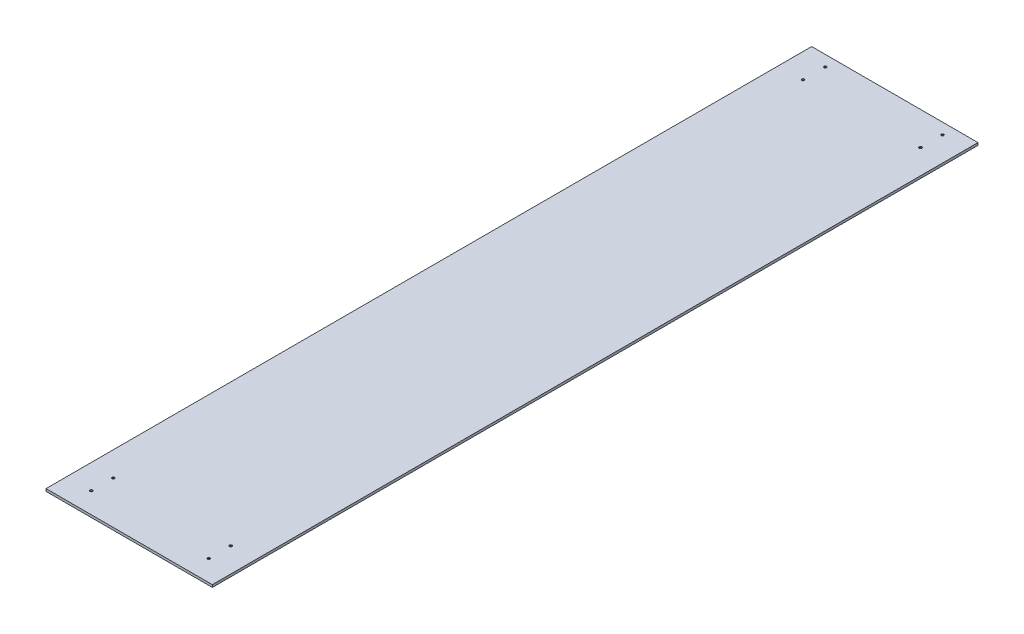
ISO-10303-21;
HEADER;
FILE_DESCRIPTION(('STEP AP214'),'2;1');
FILE_NAME('part.step','',(''),(''),'','','');
FILE_SCHEMA(('AUTOMOTIVE_DESIGN { 1 0 10303 214 1 1 1 1 }'));
ENDSEC;
DATA;
#1=APPLICATION_CONTEXT('core data for automotive mechanical design processes');
#2=APPLICATION_PROTOCOL_DEFINITION('international standard','automotive_design',2000,#1);
#3=PRODUCT_CONTEXT('',#1,'mechanical');
#4=PRODUCT('Part','Part','',(#3));
#5=PRODUCT_RELATED_PRODUCT_CATEGORY('part','',(#4));
#6=PRODUCT_DEFINITION_FORMATION('','',#4);
#7=PRODUCT_DEFINITION_CONTEXT('part definition',#1,'design');
#8=PRODUCT_DEFINITION('design','',#6,#7);
#9=PRODUCT_DEFINITION_SHAPE('','',#8);
#10=(LENGTH_UNIT() NAMED_UNIT(*) SI_UNIT(.MILLI.,.METRE.));
#11=(NAMED_UNIT(*) PLANE_ANGLE_UNIT() SI_UNIT($,.RADIAN.));
#12=(NAMED_UNIT(*) SI_UNIT($,.STERADIAN.) SOLID_ANGLE_UNIT());
#13=UNCERTAINTY_MEASURE_WITH_UNIT(LENGTH_MEASURE(1.E-05),#10,'distance_accuracy_value','');
#14=(GEOMETRIC_REPRESENTATION_CONTEXT(3) GLOBAL_UNCERTAINTY_ASSIGNED_CONTEXT((#13)) GLOBAL_UNIT_ASSIGNED_CONTEXT((#10,
#11,#12)) REPRESENTATION_CONTEXT('',''));
#15=CARTESIAN_POINT('',(0.,0.,0.));
#16=DIRECTION('',(0.,0.,1.));
#17=DIRECTION('',(1.,0.,0.));
#18=AXIS2_PLACEMENT_3D('',#15,#16,#17);
#19=CARTESIAN_POINT('',(0.,-6.35,993.775));
#20=DIRECTION('',(-1.,0.,0.));
#21=DIRECTION('',(0.,0.,1.));
#22=AXIS2_PLACEMENT_3D('',#19,#20,#21);
#23=PLANE('',#22);
#24=DIRECTION('',(0.,0.,1.));
#25=VECTOR('',#24,1.);
#26=CARTESIAN_POINT('',(0.,0.,993.775));
#27=LINE('',#26,#25);
#28=CARTESIAN_POINT('',(0.,0.,0.));
#29=VERTEX_POINT('',#28);
#30=CARTESIAN_POINT('',(-3.60822483003176E-13,0.,1987.55));
#31=VERTEX_POINT('',#30);
#32=EDGE_CURVE('E102',#29,#31,#27,.T.);
#33=ORIENTED_EDGE('',*,*,#32,.F.);
#34=DIRECTION('',(0.,1.,0.));
#35=VECTOR('',#34,1.);
#36=CARTESIAN_POINT('',(0.,-6.35,0.));
#37=LINE('',#36,#35);
#38=CARTESIAN_POINT('',(0.,-6.35,0.));
#39=VERTEX_POINT('',#38);
#40=EDGE_CURVE('E9',#39,#29,#37,.T.);
#41=ORIENTED_EDGE('',*,*,#40,.F.);
#42=DIRECTION('',(0.,0.,1.));
#43=VECTOR('',#42,1.);
#44=CARTESIAN_POINT('',(0.,-6.35,993.775));
#45=LINE('',#44,#43);
#46=CARTESIAN_POINT('',(-3.60822483003176E-13,-6.35,1987.55));
#47=VERTEX_POINT('',#46);
#48=EDGE_CURVE('E79',#39,#47,#45,.T.);
#49=ORIENTED_EDGE('',*,*,#48,.T.);
#50=DIRECTION('',(0.,1.,0.));
#51=VECTOR('',#50,1.);
#52=CARTESIAN_POINT('',(-3.60822483003176E-13,-6.35,1987.55));
#53=LINE('',#52,#51);
#54=EDGE_CURVE('E38',#47,#31,#53,.T.);
#55=ORIENTED_EDGE('',*,*,#54,.T.);
#56=EDGE_LOOP('',(#33,#41,#49,#55));
#57=FACE_BOUND('',#56,.T.);
#58=ADVANCED_FACE('F14',(#57),#23,.T.);
#59=CARTESIAN_POINT('',(215.9,-6.35,0.));
#60=DIRECTION('',(0.,0.,1.));
#61=DIRECTION('',(1.,0.,0.));
#62=AXIS2_PLACEMENT_3D('',#59,#60,#61);
#63=PLANE('',#62);
#64=DIRECTION('',(1.,0.,0.));
#65=VECTOR('',#64,1.);
#66=CARTESIAN_POINT('',(215.9,0.,0.));
#67=LINE('',#66,#65);
#68=CARTESIAN_POINT('',(431.8,0.,0.));
#69=VERTEX_POINT('',#68);
#70=EDGE_CURVE('E86',#29,#69,#67,.T.);
#71=ORIENTED_EDGE('',*,*,#70,.T.);
#72=DIRECTION('',(0.,1.,0.));
#73=VECTOR('',#72,1.);
#74=CARTESIAN_POINT('',(431.8,-6.35,0.));
#75=LINE('',#74,#73);
#76=CARTESIAN_POINT('',(431.8,-6.35,0.));
#77=VERTEX_POINT('',#76);
#78=EDGE_CURVE('E24',#77,#69,#75,.T.);
#79=ORIENTED_EDGE('',*,*,#78,.F.);
#80=DIRECTION('',(1.,0.,0.));
#81=VECTOR('',#80,1.);
#82=CARTESIAN_POINT('',(215.9,-6.35,0.));
#83=LINE('',#82,#81);
#84=EDGE_CURVE('E73',#39,#77,#83,.T.);
#85=ORIENTED_EDGE('',*,*,#84,.F.);
#86=ORIENTED_EDGE('',*,*,#40,.T.);
#87=EDGE_LOOP('',(#71,#79,#85,#86));
#88=FACE_BOUND('',#87,.T.);
#89=ADVANCED_FACE('F84',(#88),#63,.F.);
#90=CARTESIAN_POINT('',(431.8,-6.35,993.775));
#91=DIRECTION('',(-1.,0.,0.));
#92=DIRECTION('',(0.,0.,1.));
#93=AXIS2_PLACEMENT_3D('',#90,#91,#92);
#94=PLANE('',#93);
#95=DIRECTION('',(0.,0.,1.));
#96=VECTOR('',#95,1.);
#97=CARTESIAN_POINT('',(431.8,0.,993.775));
#98=LINE('',#97,#96);
#99=CARTESIAN_POINT('',(431.8,0.,1987.55));
#100=VERTEX_POINT('',#99);
#101=EDGE_CURVE('E108',#69,#100,#98,.T.);
#102=ORIENTED_EDGE('',*,*,#101,.T.);
#103=DIRECTION('',(0.,1.,0.));
#104=VECTOR('',#103,1.);
#105=CARTESIAN_POINT('',(431.8,-6.35,1987.55));
#106=LINE('',#105,#104);
#107=CARTESIAN_POINT('',(431.8,-6.35,1987.55));
#108=VERTEX_POINT('',#107);
#109=EDGE_CURVE('E56',#108,#100,#106,.T.);
#110=ORIENTED_EDGE('',*,*,#109,.F.);
#111=DIRECTION('',(0.,0.,1.));
#112=VECTOR('',#111,1.);
#113=CARTESIAN_POINT('',(431.8,-6.35,993.775));
#114=LINE('',#113,#112);
#115=EDGE_CURVE('E78',#77,#108,#114,.T.);
#116=ORIENTED_EDGE('',*,*,#115,.F.);
#117=ORIENTED_EDGE('',*,*,#78,.T.);
#118=EDGE_LOOP('',(#102,#110,#116,#117));
#119=FACE_BOUND('',#118,.T.);
#120=ADVANCED_FACE('F91',(#119),#94,.F.);
#121=CARTESIAN_POINT('',(215.9,-6.35,1987.55));
#122=DIRECTION('',(0.,0.,1.));
#123=DIRECTION('',(1.,0.,0.));
#124=AXIS2_PLACEMENT_3D('',#121,#122,#123);
#125=PLANE('',#124);
#126=DIRECTION('',(1.,0.,0.));
#127=VECTOR('',#126,1.);
#128=CARTESIAN_POINT('',(215.9,0.,1987.55));
#129=LINE('',#128,#127);
#130=EDGE_CURVE('E110',#31,#100,#129,.T.);
#131=ORIENTED_EDGE('',*,*,#130,.F.);
#132=ORIENTED_EDGE('',*,*,#54,.F.);
#133=DIRECTION('',(1.,0.,0.));
#134=VECTOR('',#133,1.);
#135=CARTESIAN_POINT('',(215.9,-6.35,1987.55));
#136=LINE('',#135,#134);
#137=EDGE_CURVE('E93',#47,#108,#136,.T.);
#138=ORIENTED_EDGE('',*,*,#137,.T.);
#139=ORIENTED_EDGE('',*,*,#109,.T.);
#140=EDGE_LOOP('',(#131,#132,#138,#139));
#141=FACE_BOUND('',#140,.T.);
#142=ADVANCED_FACE('F210',(#141),#125,.T.);
#143=CARTESIAN_POINT('',(215.9,-6.35,993.775));
#144=DIRECTION('',(0.,-1.,0.));
#145=DIRECTION('',(1.,0.,0.));
#146=AXIS2_PLACEMENT_3D('',#143,#144,#145);
#147=PLANE('',#146);
#148=CARTESIAN_POINT('',(368.3,-6.34999999999986,28.575));
#149=DIRECTION('',(0.,-1.,0.));
#150=DIRECTION('',(0.,0.,-1.));
#151=AXIS2_PLACEMENT_3D('',#148,#149,#150);
#152=CIRCLE('',#151,6.7437);
#153=CARTESIAN_POINT('',(368.3,-6.34999999999986,21.8313));
#154=VERTEX_POINT('',#153);
#155=EDGE_CURVE('E450',#154,#154,#152,.T.);
#156=ORIENTED_EDGE('',*,*,#155,.F.);
#157=EDGE_LOOP('',(#156));
#158=FACE_BOUND('',#157,.T.);
#159=CARTESIAN_POINT('',(368.3,-6.34999999999986,85.725));
#160=DIRECTION('',(0.,-1.,0.));
#161=DIRECTION('',(0.,0.,-1.));
#162=AXIS2_PLACEMENT_3D('',#159,#160,#161);
#163=CIRCLE('',#162,6.7437);
#164=CARTESIAN_POINT('',(368.3,-6.34999999999986,78.9813));
#165=VERTEX_POINT('',#164);
#166=EDGE_CURVE('E166',#165,#165,#163,.T.);
#167=ORIENTED_EDGE('',*,*,#166,.F.);
#168=EDGE_LOOP('',(#167));
#169=FACE_BOUND('',#168,.T.);
#170=CARTESIAN_POINT('',(368.3,-6.34999999999986,1933.575));
#171=DIRECTION('',(0.,-1.,0.));
#172=DIRECTION('',(0.,0.,-1.));
#173=AXIS2_PLACEMENT_3D('',#170,#171,#172);
#174=CIRCLE('',#173,6.7437);
#175=CARTESIAN_POINT('',(368.3,-6.34999999999986,1926.8313));
#176=VERTEX_POINT('',#175);
#177=EDGE_CURVE('E154',#176,#176,#174,.T.);
#178=ORIENTED_EDGE('',*,*,#177,.F.);
#179=EDGE_LOOP('',(#178));
#180=FACE_BOUND('',#179,.T.);
#181=CARTESIAN_POINT('',(368.3,-6.34999999999986,1876.425));
#182=DIRECTION('',(0.,-1.,0.));
#183=DIRECTION('',(0.,0.,-1.));
#184=AXIS2_PLACEMENT_3D('',#181,#182,#183);
#185=CIRCLE('',#184,6.7437);
#186=CARTESIAN_POINT('',(368.3,-6.34999999999986,1869.6813));
#187=VERTEX_POINT('',#186);
#188=EDGE_CURVE('E149',#187,#187,#185,.T.);
#189=ORIENTED_EDGE('',*,*,#188,.F.);
#190=EDGE_LOOP('',(#189));
#191=FACE_BOUND('',#190,.T.);
#192=CARTESIAN_POINT('',(63.5,-6.34999999999986,1933.575));
#193=DIRECTION('',(0.,-1.,0.));
#194=DIRECTION('',(0.,0.,-1.));
#195=AXIS2_PLACEMENT_3D('',#192,#193,#194);
#196=CIRCLE('',#195,6.7437);
#197=CARTESIAN_POINT('',(63.5,-6.34999999999986,1926.8313));
#198=VERTEX_POINT('',#197);
#199=EDGE_CURVE('E144',#198,#198,#196,.T.);
#200=ORIENTED_EDGE('',*,*,#199,.F.);
#201=EDGE_LOOP('',(#200));
#202=FACE_BOUND('',#201,.T.);
#203=CARTESIAN_POINT('',(63.5,-6.34999999999986,1876.425));
#204=DIRECTION('',(0.,-1.,0.));
#205=DIRECTION('',(0.,0.,-1.));
#206=AXIS2_PLACEMENT_3D('',#203,#204,#205);
#207=CIRCLE('',#206,6.7437);
#208=CARTESIAN_POINT('',(63.5,-6.34999999999986,1869.6813));
#209=VERTEX_POINT('',#208);
#210=EDGE_CURVE('E138',#209,#209,#207,.T.);
#211=ORIENTED_EDGE('',*,*,#210,.F.);
#212=EDGE_LOOP('',(#211));
#213=FACE_BOUND('',#212,.T.);
#214=CARTESIAN_POINT('',(63.5,-6.34999999999986,85.725));
#215=DIRECTION('',(0.,-1.,0.));
#216=DIRECTION('',(0.,0.,-1.));
#217=AXIS2_PLACEMENT_3D('',#214,#215,#216);
#218=CIRCLE('',#217,6.7437);
#219=CARTESIAN_POINT('',(63.5,-6.34999999999986,78.9813));
#220=VERTEX_POINT('',#219);
#221=EDGE_CURVE('E132',#220,#220,#218,.T.);
#222=ORIENTED_EDGE('',*,*,#221,.F.);
#223=EDGE_LOOP('',(#222));
#224=FACE_BOUND('',#223,.T.);
#225=CARTESIAN_POINT('',(63.5,-6.34999999999986,28.575));
#226=DIRECTION('',(0.,-1.,0.));
#227=DIRECTION('',(0.,0.,-1.));
#228=AXIS2_PLACEMENT_3D('',#225,#226,#227);
#229=CIRCLE('',#228,6.7437);
#230=CARTESIAN_POINT('',(63.5,-6.34999999999986,21.8313));
#231=VERTEX_POINT('',#230);
#232=EDGE_CURVE('E126',#231,#231,#229,.T.);
#233=ORIENTED_EDGE('',*,*,#232,.F.);
#234=EDGE_LOOP('',(#233));
#235=FACE_BOUND('',#234,.T.);
#236=ORIENTED_EDGE('',*,*,#48,.F.);
#237=ORIENTED_EDGE('',*,*,#84,.T.);
#238=ORIENTED_EDGE('',*,*,#115,.T.);
#239=ORIENTED_EDGE('',*,*,#137,.F.);
#240=EDGE_LOOP('',(#236,#237,#238,#239));
#241=FACE_BOUND('',#240,.T.);
#242=ADVANCED_FACE('F75',(#158,#169,#180,#191,#202,#213,#224,#235,#241),#147,.T.);
#243=CARTESIAN_POINT('',(215.9,0.,993.775));
#244=DIRECTION('',(0.,-1.,0.));
#245=DIRECTION('',(1.,0.,0.));
#246=AXIS2_PLACEMENT_3D('',#243,#244,#245);
#247=PLANE('',#246);
#248=CARTESIAN_POINT('',(368.3,0.,28.575));
#249=DIRECTION('',(0.,-1.,0.));
#250=DIRECTION('',(0.,0.,-1.));
#251=AXIS2_PLACEMENT_3D('',#248,#249,#250);
#252=CIRCLE('',#251,3.3782);
#253=CARTESIAN_POINT('',(368.3,0.,25.1968));
#254=VERTEX_POINT('',#253);
#255=EDGE_CURVE('E17',#254,#254,#252,.F.);
#256=ORIENTED_EDGE('',*,*,#255,.F.);
#257=EDGE_LOOP('',(#256));
#258=FACE_BOUND('',#257,.T.);
#259=CARTESIAN_POINT('',(368.3,0.,85.725));
#260=DIRECTION('',(0.,-1.,0.));
#261=DIRECTION('',(0.,0.,-1.));
#262=AXIS2_PLACEMENT_3D('',#259,#260,#261);
#263=CIRCLE('',#262,3.3782);
#264=CARTESIAN_POINT('',(368.3,0.,82.3468));
#265=VERTEX_POINT('',#264);
#266=EDGE_CURVE('E151',#265,#265,#263,.F.);
#267=ORIENTED_EDGE('',*,*,#266,.F.);
#268=EDGE_LOOP('',(#267));
#269=FACE_BOUND('',#268,.T.);
#270=CARTESIAN_POINT('',(368.3,0.,1933.575));
#271=DIRECTION('',(0.,-1.,0.));
#272=DIRECTION('',(0.,0.,-1.));
#273=AXIS2_PLACEMENT_3D('',#270,#271,#272);
#274=CIRCLE('',#273,3.3782);
#275=CARTESIAN_POINT('',(368.3,0.,1930.1968));
#276=VERTEX_POINT('',#275);
#277=EDGE_CURVE('E146',#276,#276,#274,.F.);
#278=ORIENTED_EDGE('',*,*,#277,.F.);
#279=EDGE_LOOP('',(#278));
#280=FACE_BOUND('',#279,.T.);
#281=CARTESIAN_POINT('',(368.3,0.,1876.425));
#282=DIRECTION('',(0.,-1.,0.));
#283=DIRECTION('',(0.,0.,-1.));
#284=AXIS2_PLACEMENT_3D('',#281,#282,#283);
#285=CIRCLE('',#284,3.3782);
#286=CARTESIAN_POINT('',(368.3,0.,1873.0468));
#287=VERTEX_POINT('',#286);
#288=EDGE_CURVE('E140',#287,#287,#285,.F.);
#289=ORIENTED_EDGE('',*,*,#288,.F.);
#290=EDGE_LOOP('',(#289));
#291=FACE_BOUND('',#290,.T.);
#292=CARTESIAN_POINT('',(63.5,0.,1933.575));
#293=DIRECTION('',(0.,-1.,0.));
#294=DIRECTION('',(0.,0.,-1.));
#295=AXIS2_PLACEMENT_3D('',#292,#293,#294);
#296=CIRCLE('',#295,3.3782);
#297=CARTESIAN_POINT('',(63.5,0.,1930.1968));
#298=VERTEX_POINT('',#297);
#299=EDGE_CURVE('E134',#298,#298,#296,.F.);
#300=ORIENTED_EDGE('',*,*,#299,.F.);
#301=EDGE_LOOP('',(#300));
#302=FACE_BOUND('',#301,.T.);
#303=CARTESIAN_POINT('',(63.5,0.,1876.425));
#304=DIRECTION('',(0.,-1.,0.));
#305=DIRECTION('',(0.,0.,-1.));
#306=AXIS2_PLACEMENT_3D('',#303,#304,#305);
#307=CIRCLE('',#306,3.3782);
#308=CARTESIAN_POINT('',(63.5,0.,1873.0468));
#309=VERTEX_POINT('',#308);
#310=EDGE_CURVE('E128',#309,#309,#307,.F.);
#311=ORIENTED_EDGE('',*,*,#310,.F.);
#312=EDGE_LOOP('',(#311));
#313=FACE_BOUND('',#312,.T.);
#314=CARTESIAN_POINT('',(63.5,0.,85.725));
#315=DIRECTION('',(0.,-1.,0.));
#316=DIRECTION('',(0.,0.,-1.));
#317=AXIS2_PLACEMENT_3D('',#314,#315,#316);
#318=CIRCLE('',#317,3.3782);
#319=CARTESIAN_POINT('',(63.5,0.,82.3468));
#320=VERTEX_POINT('',#319);
#321=EDGE_CURVE('E122',#320,#320,#318,.F.);
#322=ORIENTED_EDGE('',*,*,#321,.F.);
#323=EDGE_LOOP('',(#322));
#324=FACE_BOUND('',#323,.T.);
#325=CARTESIAN_POINT('',(63.5,0.,28.575));
#326=DIRECTION('',(0.,-1.,0.));
#327=DIRECTION('',(0.,0.,-1.));
#328=AXIS2_PLACEMENT_3D('',#325,#326,#327);
#329=CIRCLE('',#328,3.3782);
#330=CARTESIAN_POINT('',(63.5,0.,25.1968));
#331=VERTEX_POINT('',#330);
#332=EDGE_CURVE('E105',#331,#331,#329,.F.);
#333=ORIENTED_EDGE('',*,*,#332,.F.);
#334=EDGE_LOOP('',(#333));
#335=FACE_BOUND('',#334,.T.);
#336=ORIENTED_EDGE('',*,*,#32,.T.);
#337=ORIENTED_EDGE('',*,*,#130,.T.);
#338=ORIENTED_EDGE('',*,*,#101,.F.);
#339=ORIENTED_EDGE('',*,*,#70,.F.);
#340=EDGE_LOOP('',(#336,#337,#338,#339));
#341=FACE_BOUND('',#340,.T.);
#342=ADVANCED_FACE('F218',(#258,#269,#280,#291,#302,#313,#324,#335,#341),#247,.F.);
#343=CARTESIAN_POINT('',(63.5,2028.58884661501,28.575));
#344=DIRECTION('',(0.,-1.,0.));
#345=DIRECTION('',(0.,0.,-1.));
#346=AXIS2_PLACEMENT_3D('',#343,#344,#345);
#347=CYLINDRICAL_SURFACE('',#346,3.3782);
#348=CARTESIAN_POINT('',(63.5,-2.47843512549739,28.575));
#349=DIRECTION('',(0.,-1.,0.));
#350=DIRECTION('',(0.,0.,-1.));
#351=AXIS2_PLACEMENT_3D('',#348,#349,#350);
#352=CIRCLE('',#351,3.3782);
#353=CARTESIAN_POINT('',(63.5,-2.47843512549739,25.1968));
#354=VERTEX_POINT('',#353);
#355=EDGE_CURVE('E121',#354,#354,#352,.T.);
#356=ORIENTED_EDGE('',*,*,#355,.T.);
#357=EDGE_LOOP('',(#356));
#358=FACE_BOUND('',#357,.T.);
#359=ORIENTED_EDGE('',*,*,#332,.T.);
#360=EDGE_LOOP('',(#359));
#361=FACE_BOUND('',#360,.T.);
#362=ADVANCED_FACE('F260',(#358,#361),#347,.F.);
#363=CARTESIAN_POINT('',(63.5,-2.47843512549739,28.575));
#364=DIRECTION('',(0.,-1.,0.));
#365=DIRECTION('',(0.,0.,-1.));
#366=AXIS2_PLACEMENT_3D('',#363,#364,#365);
#367=CONICAL_SURFACE('',#366,3.3782,0.715584993317657);
#368=ORIENTED_EDGE('',*,*,#232,.T.);
#369=EDGE_LOOP('',(#368));
#370=FACE_BOUND('',#369,.T.);
#371=ORIENTED_EDGE('',*,*,#355,.F.);
#372=EDGE_LOOP('',(#371));
#373=FACE_BOUND('',#372,.T.);
#374=ADVANCED_FACE('F270',(#370,#373),#367,.F.);
#375=CARTESIAN_POINT('',(63.5,2028.58884661501,85.725));
#376=DIRECTION('',(0.,-1.,0.));
#377=DIRECTION('',(0.,0.,-1.));
#378=AXIS2_PLACEMENT_3D('',#375,#376,#377);
#379=CYLINDRICAL_SURFACE('',#378,3.3782);
#380=CARTESIAN_POINT('',(63.5,-2.47843512549739,85.725));
#381=DIRECTION('',(0.,-1.,0.));
#382=DIRECTION('',(0.,0.,-1.));
#383=AXIS2_PLACEMENT_3D('',#380,#381,#382);
#384=CIRCLE('',#383,3.3782);
#385=CARTESIAN_POINT('',(63.5,-2.47843512549739,82.3468));
#386=VERTEX_POINT('',#385);
#387=EDGE_CURVE('E127',#386,#386,#384,.T.);
#388=ORIENTED_EDGE('',*,*,#387,.T.);
#389=EDGE_LOOP('',(#388));
#390=FACE_BOUND('',#389,.T.);
#391=ORIENTED_EDGE('',*,*,#321,.T.);
#392=EDGE_LOOP('',(#391));
#393=FACE_BOUND('',#392,.T.);
#394=ADVANCED_FACE('F281',(#390,#393),#379,.F.);
#395=CARTESIAN_POINT('',(63.5,-2.47843512549739,85.725));
#396=DIRECTION('',(0.,-1.,0.));
#397=DIRECTION('',(0.,0.,-1.));
#398=AXIS2_PLACEMENT_3D('',#395,#396,#397);
#399=CONICAL_SURFACE('',#398,3.3782,0.715584993317657);
#400=ORIENTED_EDGE('',*,*,#221,.T.);
#401=EDGE_LOOP('',(#400));
#402=FACE_BOUND('',#401,.T.);
#403=ORIENTED_EDGE('',*,*,#387,.F.);
#404=EDGE_LOOP('',(#403));
#405=FACE_BOUND('',#404,.T.);
#406=ADVANCED_FACE('F292',(#402,#405),#399,.F.);
#407=CARTESIAN_POINT('',(63.5,2028.58884661501,1876.425));
#408=DIRECTION('',(0.,-1.,0.));
#409=DIRECTION('',(0.,0.,-1.));
#410=AXIS2_PLACEMENT_3D('',#407,#408,#409);
#411=CYLINDRICAL_SURFACE('',#410,3.3782);
#412=CARTESIAN_POINT('',(63.5,-2.47843512549739,1876.425));
#413=DIRECTION('',(0.,-1.,0.));
#414=DIRECTION('',(0.,0.,-1.));
#415=AXIS2_PLACEMENT_3D('',#412,#413,#414);
#416=CIRCLE('',#415,3.3782);
#417=CARTESIAN_POINT('',(63.5,-2.47843512549739,1873.0468));
#418=VERTEX_POINT('',#417);
#419=EDGE_CURVE('E133',#418,#418,#416,.T.);
#420=ORIENTED_EDGE('',*,*,#419,.T.);
#421=EDGE_LOOP('',(#420));
#422=FACE_BOUND('',#421,.T.);
#423=ORIENTED_EDGE('',*,*,#310,.T.);
#424=EDGE_LOOP('',(#423));
#425=FACE_BOUND('',#424,.T.);
#426=ADVANCED_FACE('F303',(#422,#425),#411,.F.);
#427=CARTESIAN_POINT('',(63.5,-2.47843512549739,1876.425));
#428=DIRECTION('',(0.,-1.,0.));
#429=DIRECTION('',(0.,0.,-1.));
#430=AXIS2_PLACEMENT_3D('',#427,#428,#429);
#431=CONICAL_SURFACE('',#430,3.3782,0.715584993317657);
#432=ORIENTED_EDGE('',*,*,#210,.T.);
#433=EDGE_LOOP('',(#432));
#434=FACE_BOUND('',#433,.T.);
#435=ORIENTED_EDGE('',*,*,#419,.F.);
#436=EDGE_LOOP('',(#435));
#437=FACE_BOUND('',#436,.T.);
#438=ADVANCED_FACE('F314',(#434,#437),#431,.F.);
#439=CARTESIAN_POINT('',(63.5,2028.58884661501,1933.575));
#440=DIRECTION('',(0.,-1.,0.));
#441=DIRECTION('',(0.,0.,-1.));
#442=AXIS2_PLACEMENT_3D('',#439,#440,#441);
#443=CYLINDRICAL_SURFACE('',#442,3.3782);
#444=CARTESIAN_POINT('',(63.5,-2.47843512549739,1933.575));
#445=DIRECTION('',(0.,-1.,0.));
#446=DIRECTION('',(0.,0.,-1.));
#447=AXIS2_PLACEMENT_3D('',#444,#445,#446);
#448=CIRCLE('',#447,3.3782);
#449=CARTESIAN_POINT('',(63.5,-2.47843512549739,1930.1968));
#450=VERTEX_POINT('',#449);
#451=EDGE_CURVE('E139',#450,#450,#448,.T.);
#452=ORIENTED_EDGE('',*,*,#451,.T.);
#453=EDGE_LOOP('',(#452));
#454=FACE_BOUND('',#453,.T.);
#455=ORIENTED_EDGE('',*,*,#299,.T.);
#456=EDGE_LOOP('',(#455));
#457=FACE_BOUND('',#456,.T.);
#458=ADVANCED_FACE('F325',(#454,#457),#443,.F.);
#459=CARTESIAN_POINT('',(63.5,-2.47843512549739,1933.575));
#460=DIRECTION('',(0.,-1.,0.));
#461=DIRECTION('',(0.,0.,-1.));
#462=AXIS2_PLACEMENT_3D('',#459,#460,#461);
#463=CONICAL_SURFACE('',#462,3.3782,0.715584993317657);
#464=ORIENTED_EDGE('',*,*,#199,.T.);
#465=EDGE_LOOP('',(#464));
#466=FACE_BOUND('',#465,.T.);
#467=ORIENTED_EDGE('',*,*,#451,.F.);
#468=EDGE_LOOP('',(#467));
#469=FACE_BOUND('',#468,.T.);
#470=ADVANCED_FACE('F336',(#466,#469),#463,.F.);
#471=CARTESIAN_POINT('',(368.3,2028.58884661501,1876.425));
#472=DIRECTION('',(0.,-1.,0.));
#473=DIRECTION('',(0.,0.,-1.));
#474=AXIS2_PLACEMENT_3D('',#471,#472,#473);
#475=CYLINDRICAL_SURFACE('',#474,3.3782);
#476=CARTESIAN_POINT('',(368.3,-2.47843512549739,1876.425));
#477=DIRECTION('',(0.,-1.,0.));
#478=DIRECTION('',(0.,0.,-1.));
#479=AXIS2_PLACEMENT_3D('',#476,#477,#478);
#480=CIRCLE('',#479,3.3782);
#481=CARTESIAN_POINT('',(368.3,-2.47843512549739,1873.0468));
#482=VERTEX_POINT('',#481);
#483=EDGE_CURVE('E145',#482,#482,#480,.T.);
#484=ORIENTED_EDGE('',*,*,#483,.T.);
#485=EDGE_LOOP('',(#484));
#486=FACE_BOUND('',#485,.T.);
#487=ORIENTED_EDGE('',*,*,#288,.T.);
#488=EDGE_LOOP('',(#487));
#489=FACE_BOUND('',#488,.T.);
#490=ADVANCED_FACE('F347',(#486,#489),#475,.F.);
#491=CARTESIAN_POINT('',(368.3,-2.47843512549739,1876.425));
#492=DIRECTION('',(0.,-1.,0.));
#493=DIRECTION('',(0.,0.,-1.));
#494=AXIS2_PLACEMENT_3D('',#491,#492,#493);
#495=CONICAL_SURFACE('',#494,3.3782,0.715584993317659);
#496=ORIENTED_EDGE('',*,*,#188,.T.);
#497=EDGE_LOOP('',(#496));
#498=FACE_BOUND('',#497,.T.);
#499=ORIENTED_EDGE('',*,*,#483,.F.);
#500=EDGE_LOOP('',(#499));
#501=FACE_BOUND('',#500,.T.);
#502=ADVANCED_FACE('F358',(#498,#501),#495,.F.);
#503=CARTESIAN_POINT('',(368.3,2028.58884661501,1933.575));
#504=DIRECTION('',(0.,-1.,0.));
#505=DIRECTION('',(0.,0.,-1.));
#506=AXIS2_PLACEMENT_3D('',#503,#504,#505);
#507=CYLINDRICAL_SURFACE('',#506,3.3782);
#508=CARTESIAN_POINT('',(368.3,-2.47843512549739,1933.575));
#509=DIRECTION('',(0.,-1.,0.));
#510=DIRECTION('',(0.,0.,-1.));
#511=AXIS2_PLACEMENT_3D('',#508,#509,#510);
#512=CIRCLE('',#511,3.3782);
#513=CARTESIAN_POINT('',(368.3,-2.47843512549739,1930.1968));
#514=VERTEX_POINT('',#513);
#515=EDGE_CURVE('E150',#514,#514,#512,.T.);
#516=ORIENTED_EDGE('',*,*,#515,.T.);
#517=EDGE_LOOP('',(#516));
#518=FACE_BOUND('',#517,.T.);
#519=ORIENTED_EDGE('',*,*,#277,.T.);
#520=EDGE_LOOP('',(#519));
#521=FACE_BOUND('',#520,.T.);
#522=ADVANCED_FACE('F369',(#518,#521),#507,.F.);
#523=CARTESIAN_POINT('',(368.3,-2.47843512549739,1933.575));
#524=DIRECTION('',(0.,-1.,0.));
#525=DIRECTION('',(0.,0.,-1.));
#526=AXIS2_PLACEMENT_3D('',#523,#524,#525);
#527=CONICAL_SURFACE('',#526,3.3782,0.715584993317659);
#528=ORIENTED_EDGE('',*,*,#177,.T.);
#529=EDGE_LOOP('',(#528));
#530=FACE_BOUND('',#529,.T.);
#531=ORIENTED_EDGE('',*,*,#515,.F.);
#532=EDGE_LOOP('',(#531));
#533=FACE_BOUND('',#532,.T.);
#534=ADVANCED_FACE('F380',(#530,#533),#527,.F.);
#535=CARTESIAN_POINT('',(368.3,2028.58884661501,85.725));
#536=DIRECTION('',(0.,-1.,0.));
#537=DIRECTION('',(0.,0.,-1.));
#538=AXIS2_PLACEMENT_3D('',#535,#536,#537);
#539=CYLINDRICAL_SURFACE('',#538,3.3782);
#540=CARTESIAN_POINT('',(368.3,-2.47843512549739,85.725));
#541=DIRECTION('',(0.,-1.,0.));
#542=DIRECTION('',(0.,0.,-1.));
#543=AXIS2_PLACEMENT_3D('',#540,#541,#542);
#544=CIRCLE('',#543,3.3782);
#545=CARTESIAN_POINT('',(368.3,-2.47843512549739,82.3468));
#546=VERTEX_POINT('',#545);
#547=EDGE_CURVE('E155',#546,#546,#544,.T.);
#548=ORIENTED_EDGE('',*,*,#547,.T.);
#549=EDGE_LOOP('',(#548));
#550=FACE_BOUND('',#549,.T.);
#551=ORIENTED_EDGE('',*,*,#266,.T.);
#552=EDGE_LOOP('',(#551));
#553=FACE_BOUND('',#552,.T.);
#554=ADVANCED_FACE('F390',(#550,#553),#539,.F.);
#555=CARTESIAN_POINT('',(368.3,-2.47843512549739,85.725));
#556=DIRECTION('',(0.,-1.,0.));
#557=DIRECTION('',(0.,0.,-1.));
#558=AXIS2_PLACEMENT_3D('',#555,#556,#557);
#559=CONICAL_SURFACE('',#558,3.3782,0.715584993317659);
#560=ORIENTED_EDGE('',*,*,#166,.T.);
#561=EDGE_LOOP('',(#560));
#562=FACE_BOUND('',#561,.T.);
#563=ORIENTED_EDGE('',*,*,#547,.F.);
#564=EDGE_LOOP('',(#563));
#565=FACE_BOUND('',#564,.T.);
#566=ADVANCED_FACE('F401',(#562,#565),#559,.F.);
#567=CARTESIAN_POINT('',(368.3,2028.58884661501,28.575));
#568=DIRECTION('',(0.,-1.,0.));
#569=DIRECTION('',(0.,0.,-1.));
#570=AXIS2_PLACEMENT_3D('',#567,#568,#569);
#571=CYLINDRICAL_SURFACE('',#570,3.3782);
#572=CARTESIAN_POINT('',(368.3,-2.47843512549739,28.575));
#573=DIRECTION('',(0.,-1.,0.));
#574=DIRECTION('',(0.,0.,-1.));
#575=AXIS2_PLACEMENT_3D('',#572,#573,#574);
#576=CIRCLE('',#575,3.3782);
#577=CARTESIAN_POINT('',(368.3,-2.47843512549739,25.1968));
#578=VERTEX_POINT('',#577);
#579=EDGE_CURVE('E443',#578,#578,#576,.T.);
#580=ORIENTED_EDGE('',*,*,#579,.T.);
#581=EDGE_LOOP('',(#580));
#582=FACE_BOUND('',#581,.T.);
#583=ORIENTED_EDGE('',*,*,#255,.T.);
#584=EDGE_LOOP('',(#583));
#585=FACE_BOUND('',#584,.T.);
#586=ADVANCED_FACE('F411',(#582,#585),#571,.F.);
#587=CARTESIAN_POINT('',(368.3,-2.47843512549739,28.575));
#588=DIRECTION('',(0.,-1.,0.));
#589=DIRECTION('',(0.,0.,-1.));
#590=AXIS2_PLACEMENT_3D('',#587,#588,#589);
#591=CONICAL_SURFACE('',#590,3.3782,0.715584993317659);
#592=ORIENTED_EDGE('',*,*,#155,.T.);
#593=EDGE_LOOP('',(#592));
#594=FACE_BOUND('',#593,.T.);
#595=ORIENTED_EDGE('',*,*,#579,.F.);
#596=EDGE_LOOP('',(#595));
#597=FACE_BOUND('',#596,.T.);
#598=ADVANCED_FACE('F421',(#594,#597),#591,.F.);
#599=CLOSED_SHELL('',(#58,#89,#120,#142,#242,#342,#362,#374,#394,#406,#426,#438,#458,#470,#490,
#502,#522,#534,#554,#566,#586,#598));
#600=MANIFOLD_SOLID_BREP('B1',#599);
#601=ADVANCED_BREP_SHAPE_REPRESENTATION('',(#18,#600),#14);
#602=SHAPE_DEFINITION_REPRESENTATION(#9,#601);
ENDSEC;
END-ISO-10303-21;
